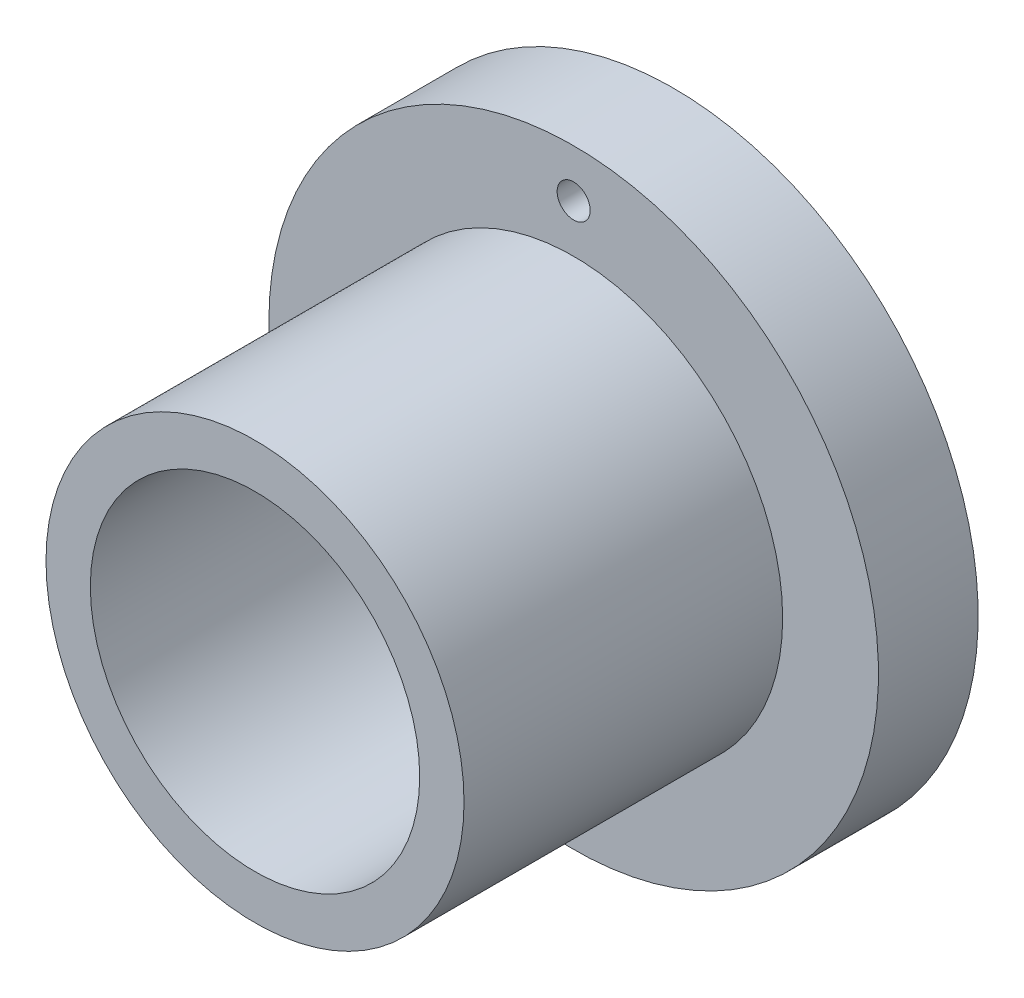
ISO-10303-21;
HEADER;
FILE_DESCRIPTION(('STEP AP214'),'2;1');
FILE_NAME('part.step','',(''),(''),'','','');
FILE_SCHEMA(('AUTOMOTIVE_DESIGN { 1 0 10303 214 1 1 1 1 }'));
ENDSEC;
DATA;
#1=APPLICATION_CONTEXT('core data for automotive mechanical design processes');
#2=APPLICATION_PROTOCOL_DEFINITION('international standard','automotive_design',2000,#1);
#3=PRODUCT_CONTEXT('',#1,'mechanical');
#4=PRODUCT('Part','Part','',(#3));
#5=PRODUCT_RELATED_PRODUCT_CATEGORY('part','',(#4));
#6=PRODUCT_DEFINITION_FORMATION('','',#4);
#7=PRODUCT_DEFINITION_CONTEXT('part definition',#1,'design');
#8=PRODUCT_DEFINITION('design','',#6,#7);
#9=PRODUCT_DEFINITION_SHAPE('','',#8);
#10=(LENGTH_UNIT() NAMED_UNIT(*) SI_UNIT(.MILLI.,.METRE.));
#11=(NAMED_UNIT(*) PLANE_ANGLE_UNIT() SI_UNIT($,.RADIAN.));
#12=(NAMED_UNIT(*) SI_UNIT($,.STERADIAN.) SOLID_ANGLE_UNIT());
#13=UNCERTAINTY_MEASURE_WITH_UNIT(LENGTH_MEASURE(1.E-05),#10,'distance_accuracy_value','');
#14=(GEOMETRIC_REPRESENTATION_CONTEXT(3) GLOBAL_UNCERTAINTY_ASSIGNED_CONTEXT((#13)) GLOBAL_UNIT_ASSIGNED_CONTEXT((#10,
#11,#12)) REPRESENTATION_CONTEXT('',''));
#15=CARTESIAN_POINT('',(0.,0.,0.));
#16=DIRECTION('',(0.,0.,1.));
#17=DIRECTION('',(1.,0.,0.));
#18=AXIS2_PLACEMENT_3D('',#15,#16,#17);
#19=CARTESIAN_POINT('',(0.,7.5436,0.));
#20=DIRECTION('',(0.,0.,1.));
#21=DIRECTION('',(1.,0.,0.));
#22=AXIS2_PLACEMENT_3D('',#19,#20,#21);
#23=PLANE('',#22);
#24=CARTESIAN_POINT('',(0.,0.,0.));
#25=DIRECTION('',(0.,0.,-1.));
#26=DIRECTION('',(-1.,0.,0.));
#27=AXIS2_PLACEMENT_3D('',#24,#25,#26);
#28=CIRCLE('',#27,5.9436);
#29=CARTESIAN_POINT('',(-5.9436,0.,0.));
#30=VERTEX_POINT('',#29);
#31=EDGE_CURVE('E62',#30,#30,#28,.T.);
#32=ORIENTED_EDGE('',*,*,#31,.T.);
#33=EDGE_LOOP('',(#32));
#34=FACE_BOUND('',#33,.T.);
#35=CARTESIAN_POINT('',(0.,0.,0.));
#36=DIRECTION('',(0.,0.,-1.));
#37=DIRECTION('',(-1.,0.,0.));
#38=AXIS2_PLACEMENT_3D('',#35,#36,#37);
#39=CIRCLE('',#38,7.5436);
#40=CARTESIAN_POINT('',(-7.5436,0.,0.));
#41=VERTEX_POINT('',#40);
#42=EDGE_CURVE('E10',#41,#41,#39,.T.);
#43=ORIENTED_EDGE('',*,*,#42,.F.);
#44=EDGE_LOOP('',(#43));
#45=FACE_BOUND('',#44,.T.);
#46=ADVANCED_FACE('F34',(#34,#45),#23,.T.);
#47=CARTESIAN_POINT('',(0.,0.,0.));
#48=DIRECTION('',(0.,0.,-1.));
#49=DIRECTION('',(-1.,0.,0.));
#50=AXIS2_PLACEMENT_3D('',#47,#48,#49);
#51=CYLINDRICAL_SURFACE('',#50,7.5436);
#52=ORIENTED_EDGE('',*,*,#42,.T.);
#53=EDGE_LOOP('',(#52));
#54=FACE_BOUND('',#53,.T.);
#55=CARTESIAN_POINT('',(0.,0.,-11.5));
#56=DIRECTION('',(0.,0.,-1.));
#57=DIRECTION('',(-1.,0.,0.));
#58=AXIS2_PLACEMENT_3D('',#55,#56,#57);
#59=CIRCLE('',#58,7.5436);
#60=CARTESIAN_POINT('',(-7.5436,0.,-11.5));
#61=VERTEX_POINT('',#60);
#62=EDGE_CURVE('E40',#61,#61,#59,.T.);
#63=ORIENTED_EDGE('',*,*,#62,.F.);
#64=EDGE_LOOP('',(#63));
#65=FACE_BOUND('',#64,.T.);
#66=ADVANCED_FACE('F112',(#54,#65),#51,.T.);
#67=CARTESIAN_POINT('',(0.,7.5436,-11.5));
#68=DIRECTION('',(0.,0.,1.));
#69=DIRECTION('',(1.,0.,0.));
#70=AXIS2_PLACEMENT_3D('',#67,#68,#69);
#71=PLANE('',#70);
#72=CARTESIAN_POINT('',(0.,-9.2718,-11.5));
#73=DIRECTION('',(0.,0.,1.));
#74=DIRECTION('',(1.,0.,0.));
#75=AXIS2_PLACEMENT_3D('',#72,#73,#74);
#76=CIRCLE('',#75,0.595629999999993);
#77=CARTESIAN_POINT('',(0.595629999999993,-9.2718,-11.5));
#78=VERTEX_POINT('',#77);
#79=EDGE_CURVE('E71',#78,#78,#76,.T.);
#80=ORIENTED_EDGE('',*,*,#79,.F.);
#81=EDGE_LOOP('',(#80));
#82=FACE_BOUND('',#81,.T.);
#83=CARTESIAN_POINT('',(0.,9.2718,-11.5));
#84=DIRECTION('',(0.,0.,1.));
#85=DIRECTION('',(1.,0.,0.));
#86=AXIS2_PLACEMENT_3D('',#83,#84,#85);
#87=CIRCLE('',#86,0.595629999999993);
#88=CARTESIAN_POINT('',(0.595629999999993,9.2718,-11.5));
#89=VERTEX_POINT('',#88);
#90=EDGE_CURVE('E65',#89,#89,#87,.T.);
#91=ORIENTED_EDGE('',*,*,#90,.F.);
#92=EDGE_LOOP('',(#91));
#93=FACE_BOUND('',#92,.T.);
#94=ORIENTED_EDGE('',*,*,#62,.T.);
#95=EDGE_LOOP('',(#94));
#96=FACE_BOUND('',#95,.T.);
#97=CARTESIAN_POINT('',(0.,0.,-11.5));
#98=DIRECTION('',(0.,0.,-1.));
#99=DIRECTION('',(-1.,0.,0.));
#100=AXIS2_PLACEMENT_3D('',#97,#98,#99);
#101=CIRCLE('',#100,11.);
#102=CARTESIAN_POINT('',(-11.,0.,-11.5));
#103=VERTEX_POINT('',#102);
#104=EDGE_CURVE('E44',#103,#103,#101,.T.);
#105=ORIENTED_EDGE('',*,*,#104,.F.);
#106=EDGE_LOOP('',(#105));
#107=FACE_BOUND('',#106,.T.);
#108=ADVANCED_FACE('F116',(#82,#93,#96,#107),#71,.T.);
#109=CARTESIAN_POINT('',(0.,0.,0.));
#110=DIRECTION('',(0.,0.,-1.));
#111=DIRECTION('',(-1.,0.,0.));
#112=AXIS2_PLACEMENT_3D('',#109,#110,#111);
#113=CYLINDRICAL_SURFACE('',#112,11.);
#114=ORIENTED_EDGE('',*,*,#104,.T.);
#115=EDGE_LOOP('',(#114));
#116=FACE_BOUND('',#115,.T.);
#117=CARTESIAN_POINT('',(0.,0.,-15.1));
#118=DIRECTION('',(0.,0.,-1.));
#119=DIRECTION('',(-1.,0.,0.));
#120=AXIS2_PLACEMENT_3D('',#117,#118,#119);
#121=CIRCLE('',#120,11.);
#122=CARTESIAN_POINT('',(-11.,0.,-15.1));
#123=VERTEX_POINT('',#122);
#124=EDGE_CURVE('E48',#123,#123,#121,.T.);
#125=ORIENTED_EDGE('',*,*,#124,.F.);
#126=EDGE_LOOP('',(#125));
#127=FACE_BOUND('',#126,.T.);
#128=ADVANCED_FACE('F84',(#116,#127),#113,.T.);
#129=CARTESIAN_POINT('',(0.,11.,-15.1));
#130=DIRECTION('',(0.,0.,-1.));
#131=DIRECTION('',(-1.,0.,0.));
#132=AXIS2_PLACEMENT_3D('',#129,#130,#131);
#133=PLANE('',#132);
#134=CARTESIAN_POINT('',(0.,-9.2718,-15.1));
#135=DIRECTION('',(0.,0.,-1.));
#136=DIRECTION('',(-1.,0.,0.));
#137=AXIS2_PLACEMENT_3D('',#134,#135,#136);
#138=CIRCLE('',#137,0.595629999999988);
#139=CARTESIAN_POINT('',(-0.595629999999988,-9.2718,-15.1));
#140=VERTEX_POINT('',#139);
#141=EDGE_CURVE('E74',#140,#140,#138,.T.);
#142=ORIENTED_EDGE('',*,*,#141,.F.);
#143=EDGE_LOOP('',(#142));
#144=FACE_BOUND('',#143,.T.);
#145=CARTESIAN_POINT('',(0.,9.2718,-15.1));
#146=DIRECTION('',(0.,0.,-1.));
#147=DIRECTION('',(-1.,0.,0.));
#148=AXIS2_PLACEMENT_3D('',#145,#146,#147);
#149=CIRCLE('',#148,0.595629999999988);
#150=CARTESIAN_POINT('',(-0.595629999999988,9.2718,-15.1));
#151=VERTEX_POINT('',#150);
#152=EDGE_CURVE('E68',#151,#151,#149,.T.);
#153=ORIENTED_EDGE('',*,*,#152,.F.);
#154=EDGE_LOOP('',(#153));
#155=FACE_BOUND('',#154,.T.);
#156=ORIENTED_EDGE('',*,*,#124,.T.);
#157=EDGE_LOOP('',(#156));
#158=FACE_BOUND('',#157,.T.);
#159=CARTESIAN_POINT('',(0.,0.,-15.1));
#160=DIRECTION('',(0.,0.,-1.));
#161=DIRECTION('',(-1.,0.,0.));
#162=AXIS2_PLACEMENT_3D('',#159,#160,#161);
#163=CIRCLE('',#162,7.5436);
#164=CARTESIAN_POINT('',(-7.5436,0.,-15.1));
#165=VERTEX_POINT('',#164);
#166=EDGE_CURVE('E53',#165,#165,#163,.T.);
#167=ORIENTED_EDGE('',*,*,#166,.F.);
#168=EDGE_LOOP('',(#167));
#169=FACE_BOUND('',#168,.T.);
#170=ADVANCED_FACE('F80',(#144,#155,#158,#169),#133,.T.);
#171=CARTESIAN_POINT('',(0.,0.,0.));
#172=DIRECTION('',(0.,0.,-1.));
#173=DIRECTION('',(-1.,0.,0.));
#174=AXIS2_PLACEMENT_3D('',#171,#172,#173);
#175=CYLINDRICAL_SURFACE('',#174,7.5436);
#176=ORIENTED_EDGE('',*,*,#166,.T.);
#177=EDGE_LOOP('',(#176));
#178=FACE_BOUND('',#177,.T.);
#179=CARTESIAN_POINT('',(0.,0.,-13.));
#180=DIRECTION('',(0.,0.,-1.));
#181=DIRECTION('',(-1.,0.,0.));
#182=AXIS2_PLACEMENT_3D('',#179,#180,#181);
#183=CIRCLE('',#182,7.5436);
#184=CARTESIAN_POINT('',(-7.5436,0.,-13.));
#185=VERTEX_POINT('',#184);
#186=EDGE_CURVE('E56',#185,#185,#183,.T.);
#187=ORIENTED_EDGE('',*,*,#186,.F.);
#188=EDGE_LOOP('',(#187));
#189=FACE_BOUND('',#188,.T.);
#190=ADVANCED_FACE('F83',(#178,#189),#175,.F.);
#191=CARTESIAN_POINT('',(0.,7.5436,-13.));
#192=DIRECTION('',(0.,0.,-1.));
#193=DIRECTION('',(-1.,0.,0.));
#194=AXIS2_PLACEMENT_3D('',#191,#192,#193);
#195=PLANE('',#194);
#196=ORIENTED_EDGE('',*,*,#186,.T.);
#197=EDGE_LOOP('',(#196));
#198=FACE_BOUND('',#197,.T.);
#199=CARTESIAN_POINT('',(0.,0.,-13.));
#200=DIRECTION('',(0.,0.,-1.));
#201=DIRECTION('',(-1.,0.,0.));
#202=AXIS2_PLACEMENT_3D('',#199,#200,#201);
#203=CIRCLE('',#202,5.9436);
#204=CARTESIAN_POINT('',(-5.9436,0.,-13.));
#205=VERTEX_POINT('',#204);
#206=EDGE_CURVE('E59',#205,#205,#203,.T.);
#207=ORIENTED_EDGE('',*,*,#206,.F.);
#208=EDGE_LOOP('',(#207));
#209=FACE_BOUND('',#208,.T.);
#210=ADVANCED_FACE('F94',(#198,#209),#195,.T.);
#211=CARTESIAN_POINT('',(0.,0.,0.));
#212=DIRECTION('',(0.,0.,-1.));
#213=DIRECTION('',(-1.,0.,0.));
#214=AXIS2_PLACEMENT_3D('',#211,#212,#213);
#215=CYLINDRICAL_SURFACE('',#214,5.9436);
#216=ORIENTED_EDGE('',*,*,#206,.T.);
#217=EDGE_LOOP('',(#216));
#218=FACE_BOUND('',#217,.T.);
#219=ORIENTED_EDGE('',*,*,#31,.F.);
#220=EDGE_LOOP('',(#219));
#221=FACE_BOUND('',#220,.T.);
#222=ADVANCED_FACE('F100',(#218,#221),#215,.F.);
#223=CARTESIAN_POINT('',(0.,9.2718,-15.1));
#224=DIRECTION('',(0.,0.,-1.));
#225=DIRECTION('',(-1.,0.,0.));
#226=AXIS2_PLACEMENT_3D('',#223,#224,#225);
#227=CYLINDRICAL_SURFACE('',#226,0.595629999999993);
#228=ORIENTED_EDGE('',*,*,#90,.T.);
#229=EDGE_LOOP('',(#228));
#230=FACE_BOUND('',#229,.T.);
#231=ORIENTED_EDGE('',*,*,#152,.T.);
#232=EDGE_LOOP('',(#231));
#233=FACE_BOUND('',#232,.T.);
#234=ADVANCED_FACE('F106',(#230,#233),#227,.F.);
#235=CARTESIAN_POINT('',(0.,-9.2718,-15.1));
#236=DIRECTION('',(0.,0.,-1.));
#237=DIRECTION('',(-1.,0.,0.));
#238=AXIS2_PLACEMENT_3D('',#235,#236,#237);
#239=CYLINDRICAL_SURFACE('',#238,0.595629999999993);
#240=ORIENTED_EDGE('',*,*,#79,.T.);
#241=EDGE_LOOP('',(#240));
#242=FACE_BOUND('',#241,.T.);
#243=ORIENTED_EDGE('',*,*,#141,.T.);
#244=EDGE_LOOP('',(#243));
#245=FACE_BOUND('',#244,.T.);
#246=ADVANCED_FACE('F78',(#242,#245),#239,.F.);
#247=CLOSED_SHELL('',(#46,#66,#108,#128,#170,#190,#210,#222,#234,#246));
#248=MANIFOLD_SOLID_BREP('B2',#247);
#249=ADVANCED_BREP_SHAPE_REPRESENTATION('',(#18,#248),#14);
#250=SHAPE_DEFINITION_REPRESENTATION(#9,#249);
ENDSEC;
END-ISO-10303-21;
